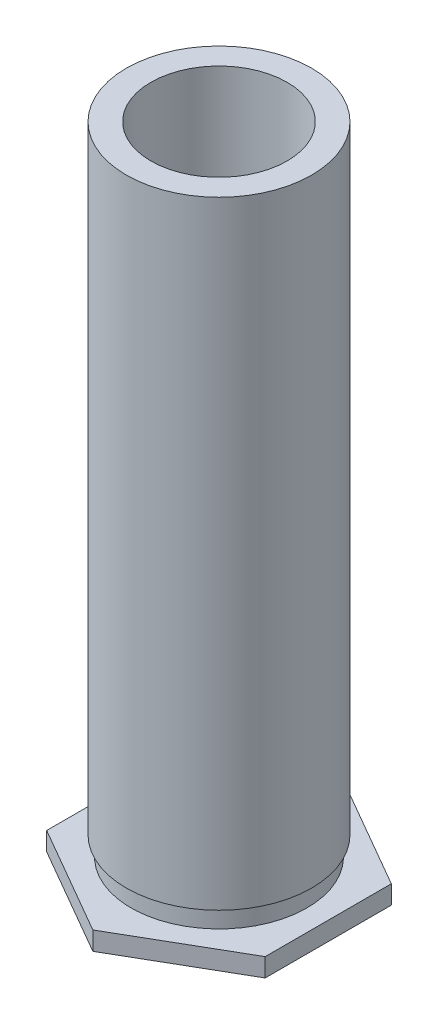
ISO-10303-21;
HEADER;
FILE_DESCRIPTION(('STEP AP214'),'2;1');
FILE_NAME('part.step','',(''),(''),'','','');
FILE_SCHEMA(('AUTOMOTIVE_DESIGN { 1 0 10303 214 1 1 1 1 }'));
ENDSEC;
DATA;
#1=APPLICATION_CONTEXT('core data for automotive mechanical design processes');
#2=APPLICATION_PROTOCOL_DEFINITION('international standard','automotive_design',2000,#1);
#3=PRODUCT_CONTEXT('',#1,'mechanical');
#4=PRODUCT('Part','Part','',(#3));
#5=PRODUCT_RELATED_PRODUCT_CATEGORY('part','',(#4));
#6=PRODUCT_DEFINITION_FORMATION('','',#4);
#7=PRODUCT_DEFINITION_CONTEXT('part definition',#1,'design');
#8=PRODUCT_DEFINITION('design','',#6,#7);
#9=PRODUCT_DEFINITION_SHAPE('','',#8);
#10=(LENGTH_UNIT() NAMED_UNIT(*) SI_UNIT(.MILLI.,.METRE.));
#11=(NAMED_UNIT(*) PLANE_ANGLE_UNIT() SI_UNIT($,.RADIAN.));
#12=(NAMED_UNIT(*) SI_UNIT($,.STERADIAN.) SOLID_ANGLE_UNIT());
#13=UNCERTAINTY_MEASURE_WITH_UNIT(LENGTH_MEASURE(1.E-05),#10,'distance_accuracy_value','');
#14=(GEOMETRIC_REPRESENTATION_CONTEXT(3) GLOBAL_UNCERTAINTY_ASSIGNED_CONTEXT((#13)) GLOBAL_UNIT_ASSIGNED_CONTEXT((#10,
#11,#12)) REPRESENTATION_CONTEXT('',''));
#15=CARTESIAN_POINT('',(0.,0.,0.));
#16=DIRECTION('',(0.,0.,1.));
#17=DIRECTION('',(1.,0.,0.));
#18=AXIS2_PLACEMENT_3D('',#15,#16,#17);
#19=CARTESIAN_POINT('',(3.683,0.53848,0.));
#20=DIRECTION('',(0.,1.,0.));
#21=DIRECTION('',(0.,0.,1.));
#22=AXIS2_PLACEMENT_3D('',#19,#20,#21);
#23=PLANE('',#22);
#24=CARTESIAN_POINT('',(0.,0.53848,0.));
#25=DIRECTION('',(0.,-1.,0.));
#26=DIRECTION('',(0.,0.,-1.));
#27=AXIS2_PLACEMENT_3D('',#24,#25,#26);
#28=CIRCLE('',#27,2.55778);
#29=CARTESIAN_POINT('',(0.,0.53848,-2.55778));
#30=VERTEX_POINT('',#29);
#31=EDGE_CURVE('E11',#30,#30,#28,.T.);
#32=ORIENTED_EDGE('',*,*,#31,.T.);
#33=EDGE_LOOP('',(#32));
#34=FACE_BOUND('',#33,.T.);
#35=DIRECTION('',(0.866025403784438,0.,0.5));
#36=VECTOR('',#35,1.);
#37=CARTESIAN_POINT('',(0.,0.53848,3.66617420935412));
#38=LINE('',#37,#36);
#39=CARTESIAN_POINT('',(-3.175,0.53848,1.83308710467706));
#40=VERTEX_POINT('',#39);
#41=CARTESIAN_POINT('',(0.,0.53848,3.66617420935412));
#42=VERTEX_POINT('',#41);
#43=EDGE_CURVE('E129',#40,#42,#38,.T.);
#44=ORIENTED_EDGE('',*,*,#43,.T.);
#45=DIRECTION('',(0.866025403784438,0.,-0.5));
#46=VECTOR('',#45,1.);
#47=CARTESIAN_POINT('',(3.175,0.53848,1.83308710467706));
#48=LINE('',#47,#46);
#49=CARTESIAN_POINT('',(3.175,0.53848,1.83308710467706));
#50=VERTEX_POINT('',#49);
#51=EDGE_CURVE('E118',#42,#50,#48,.T.);
#52=ORIENTED_EDGE('',*,*,#51,.T.);
#53=DIRECTION('',(0.,0.,-1.));
#54=VECTOR('',#53,1.);
#55=CARTESIAN_POINT('',(3.175,0.53848,-1.83308710467706));
#56=LINE('',#55,#54);
#57=CARTESIAN_POINT('',(3.175,0.53848,-1.83308710467706));
#58=VERTEX_POINT('',#57);
#59=EDGE_CURVE('E121',#50,#58,#56,.T.);
#60=ORIENTED_EDGE('',*,*,#59,.T.);
#61=DIRECTION('',(-0.866025403784438,0.,-0.5));
#62=VECTOR('',#61,1.);
#63=CARTESIAN_POINT('',(0.,0.53848,-3.66617420935412));
#64=LINE('',#63,#62);
#65=CARTESIAN_POINT('',(0.,0.53848,-3.66617420935412));
#66=VERTEX_POINT('',#65);
#67=EDGE_CURVE('E49',#58,#66,#64,.T.);
#68=ORIENTED_EDGE('',*,*,#67,.T.);
#69=DIRECTION('',(-0.866025403784438,0.,0.5));
#70=VECTOR('',#69,1.);
#71=CARTESIAN_POINT('',(-3.175,0.53848,-1.83308710467706));
#72=LINE('',#71,#70);
#73=CARTESIAN_POINT('',(-3.175,0.53848,-1.83308710467706));
#74=VERTEX_POINT('',#73);
#75=EDGE_CURVE('E94',#66,#74,#72,.T.);
#76=ORIENTED_EDGE('',*,*,#75,.T.);
#77=DIRECTION('',(0.,0.,1.));
#78=VECTOR('',#77,1.);
#79=CARTESIAN_POINT('',(-3.175,0.53848,1.83308710467706));
#80=LINE('',#79,#78);
#81=EDGE_CURVE('E126',#74,#40,#80,.T.);
#82=ORIENTED_EDGE('',*,*,#81,.T.);
#83=EDGE_LOOP('',(#44,#52,#60,#68,#76,#82));
#84=FACE_BOUND('',#83,.T.);
#85=ADVANCED_FACE('F33',(#34,#84),#23,.T.);
#86=CARTESIAN_POINT('',(2.6924,0.,0.));
#87=DIRECTION('',(0.,-1.,0.));
#88=DIRECTION('',(0.,0.,-1.));
#89=AXIS2_PLACEMENT_3D('',#86,#87,#88);
#90=PLANE('',#89);
#91=CARTESIAN_POINT('',(0.,0.,0.));
#92=DIRECTION('',(0.,-1.,0.));
#93=DIRECTION('',(0.,0.,-1.));
#94=AXIS2_PLACEMENT_3D('',#91,#92,#93);
#95=CIRCLE('',#94,2.6924);
#96=CARTESIAN_POINT('',(0.,0.,-2.6924));
#97=VERTEX_POINT('',#96);
#98=EDGE_CURVE('E148',#97,#97,#95,.T.);
#99=ORIENTED_EDGE('',*,*,#98,.F.);
#100=EDGE_LOOP('',(#99));
#101=FACE_BOUND('',#100,.T.);
#102=DIRECTION('',(0.,0.,-1.));
#103=VECTOR('',#102,1.);
#104=CARTESIAN_POINT('',(3.175,0.,-1.83308710467706));
#105=LINE('',#104,#103);
#106=CARTESIAN_POINT('',(3.175,0.,1.83308710467706));
#107=VERTEX_POINT('',#106);
#108=CARTESIAN_POINT('',(3.175,0.,-1.83308710467706));
#109=VERTEX_POINT('',#108);
#110=EDGE_CURVE('E104',#107,#109,#105,.T.);
#111=ORIENTED_EDGE('',*,*,#110,.F.);
#112=DIRECTION('',(0.866025403784438,0.,-0.5));
#113=VECTOR('',#112,1.);
#114=CARTESIAN_POINT('',(3.175,0.,1.83308710467706));
#115=LINE('',#114,#113);
#116=CARTESIAN_POINT('',(0.,0.,3.66617420935412));
#117=VERTEX_POINT('',#116);
#118=EDGE_CURVE('E57',#117,#107,#115,.T.);
#119=ORIENTED_EDGE('',*,*,#118,.F.);
#120=DIRECTION('',(0.866025403784438,0.,0.5));
#121=VECTOR('',#120,1.);
#122=CARTESIAN_POINT('',(0.,0.,3.66617420935412));
#123=LINE('',#122,#121);
#124=CARTESIAN_POINT('',(-3.175,0.,1.83308710467706));
#125=VERTEX_POINT('',#124);
#126=EDGE_CURVE('E111',#125,#117,#123,.T.);
#127=ORIENTED_EDGE('',*,*,#126,.F.);
#128=DIRECTION('',(0.,0.,1.));
#129=VECTOR('',#128,1.);
#130=CARTESIAN_POINT('',(-3.175,0.,1.83308710467706));
#131=LINE('',#130,#129);
#132=CARTESIAN_POINT('',(-3.175,0.,-1.83308710467706));
#133=VERTEX_POINT('',#132);
#134=EDGE_CURVE('E109',#133,#125,#131,.T.);
#135=ORIENTED_EDGE('',*,*,#134,.F.);
#136=DIRECTION('',(-0.866025403784438,0.,0.5));
#137=VECTOR('',#136,1.);
#138=CARTESIAN_POINT('',(-3.175,0.,-1.83308710467706));
#139=LINE('',#138,#137);
#140=CARTESIAN_POINT('',(0.,0.,-3.66617420935412));
#141=VERTEX_POINT('',#140);
#142=EDGE_CURVE('E91',#141,#133,#139,.T.);
#143=ORIENTED_EDGE('',*,*,#142,.F.);
#144=DIRECTION('',(-0.866025403784438,0.,-0.5));
#145=VECTOR('',#144,1.);
#146=CARTESIAN_POINT('',(0.,0.,-3.66617420935412));
#147=LINE('',#146,#145);
#148=EDGE_CURVE('E99',#109,#141,#147,.T.);
#149=ORIENTED_EDGE('',*,*,#148,.F.);
#150=EDGE_LOOP('',(#111,#119,#127,#135,#143,#149));
#151=FACE_BOUND('',#150,.T.);
#152=ADVANCED_FACE('F106',(#101,#151),#90,.T.);
#153=CARTESIAN_POINT('',(0.,0.,0.));
#154=DIRECTION('',(0.,-1.,0.));
#155=DIRECTION('',(0.,0.,-1.));
#156=AXIS2_PLACEMENT_3D('',#153,#154,#155);
#157=CYLINDRICAL_SURFACE('',#156,2.55778);
#158=CARTESIAN_POINT('',(0.,1.103884,0.));
#159=DIRECTION('',(0.,-1.,0.));
#160=DIRECTION('',(0.,0.,-1.));
#161=AXIS2_PLACEMENT_3D('',#158,#159,#160);
#162=CIRCLE('',#161,2.55778);
#163=CARTESIAN_POINT('',(0.,1.103884,-2.55778));
#164=VERTEX_POINT('',#163);
#165=EDGE_CURVE('E41',#164,#164,#162,.T.);
#166=ORIENTED_EDGE('',*,*,#165,.T.);
#167=EDGE_LOOP('',(#166));
#168=FACE_BOUND('',#167,.T.);
#169=ORIENTED_EDGE('',*,*,#31,.F.);
#170=EDGE_LOOP('',(#169));
#171=FACE_BOUND('',#170,.T.);
#172=ADVANCED_FACE('F187',(#168,#171),#157,.T.);
#173=CARTESIAN_POINT('',(2.6924,1.103884,0.));
#174=DIRECTION('',(0.,-1.,0.));
#175=DIRECTION('',(0.,0.,-1.));
#176=AXIS2_PLACEMENT_3D('',#173,#174,#175);
#177=PLANE('',#176);
#178=CARTESIAN_POINT('',(0.,1.103884,0.));
#179=DIRECTION('',(0.,-1.,0.));
#180=DIRECTION('',(0.,0.,-1.));
#181=AXIS2_PLACEMENT_3D('',#178,#179,#180);
#182=CIRCLE('',#181,2.6924);
#183=CARTESIAN_POINT('',(0.,1.103884,-2.6924));
#184=VERTEX_POINT('',#183);
#185=EDGE_CURVE('E158',#184,#184,#182,.T.);
#186=ORIENTED_EDGE('',*,*,#185,.T.);
#187=EDGE_LOOP('',(#186));
#188=FACE_BOUND('',#187,.T.);
#189=ORIENTED_EDGE('',*,*,#165,.F.);
#190=EDGE_LOOP('',(#189));
#191=FACE_BOUND('',#190,.T.);
#192=ADVANCED_FACE('F181',(#188,#191),#177,.T.);
#193=CARTESIAN_POINT('',(0.,0.,0.));
#194=DIRECTION('',(0.,-1.,0.));
#195=DIRECTION('',(0.,0.,-1.));
#196=AXIS2_PLACEMENT_3D('',#193,#194,#195);
#197=CYLINDRICAL_SURFACE('',#196,2.6924);
#198=CARTESIAN_POINT('',(0.,19.05,0.));
#199=DIRECTION('',(0.,-1.,0.));
#200=DIRECTION('',(0.,0.,-1.));
#201=AXIS2_PLACEMENT_3D('',#198,#199,#200);
#202=CIRCLE('',#201,2.6924);
#203=CARTESIAN_POINT('',(0.,19.05,-2.6924));
#204=VERTEX_POINT('',#203);
#205=EDGE_CURVE('E155',#204,#204,#202,.T.);
#206=ORIENTED_EDGE('',*,*,#205,.T.);
#207=EDGE_LOOP('',(#206));
#208=FACE_BOUND('',#207,.T.);
#209=ORIENTED_EDGE('',*,*,#185,.F.);
#210=EDGE_LOOP('',(#209));
#211=FACE_BOUND('',#210,.T.);
#212=ADVANCED_FACE('F175',(#208,#211),#197,.T.);
#213=CARTESIAN_POINT('',(2.6924,19.05,0.));
#214=DIRECTION('',(0.,1.,0.));
#215=DIRECTION('',(0.,0.,1.));
#216=AXIS2_PLACEMENT_3D('',#213,#214,#215);
#217=PLANE('',#216);
#218=CARTESIAN_POINT('',(0.,19.05,0.));
#219=DIRECTION('',(0.,1.,0.));
#220=DIRECTION('',(0.,0.,1.));
#221=AXIS2_PLACEMENT_3D('',#218,#219,#220);
#222=CIRCLE('',#221,1.9812);
#223=CARTESIAN_POINT('',(0.,19.05,1.9812));
#224=VERTEX_POINT('',#223);
#225=EDGE_CURVE('E36',#224,#224,#222,.T.);
#226=ORIENTED_EDGE('',*,*,#225,.F.);
#227=EDGE_LOOP('',(#226));
#228=FACE_BOUND('',#227,.T.);
#229=ORIENTED_EDGE('',*,*,#205,.F.);
#230=EDGE_LOOP('',(#229));
#231=FACE_BOUND('',#230,.T.);
#232=ADVANCED_FACE('F171',(#228,#231),#217,.T.);
#233=CARTESIAN_POINT('',(0.,0.,0.));
#234=DIRECTION('',(0.,-1.,0.));
#235=DIRECTION('',(0.,0.,-1.));
#236=AXIS2_PLACEMENT_3D('',#233,#234,#235);
#237=CYLINDRICAL_SURFACE('',#236,1.35255);
#238=CARTESIAN_POINT('',(0.,10.8451860165415,0.));
#239=DIRECTION('',(0.,-1.,0.));
#240=DIRECTION('',(0.,0.,-1.));
#241=AXIS2_PLACEMENT_3D('',#238,#239,#240);
#242=CIRCLE('',#241,1.35255);
#243=CARTESIAN_POINT('',(0.,10.8451860165415,-1.35255));
#244=VERTEX_POINT('',#243);
#245=EDGE_CURVE('E142',#244,#244,#242,.T.);
#246=ORIENTED_EDGE('',*,*,#245,.F.);
#247=EDGE_LOOP('',(#246));
#248=FACE_BOUND('',#247,.T.);
#249=CARTESIAN_POINT('',(0.,0.00253999999999972,0.));
#250=DIRECTION('',(0.,-1.,0.));
#251=DIRECTION('',(0.,0.,-1.));
#252=AXIS2_PLACEMENT_3D('',#249,#250,#251);
#253=CIRCLE('',#252,1.35255);
#254=CARTESIAN_POINT('',(0.,0.00253999999999972,-1.35255));
#255=VERTEX_POINT('',#254);
#256=EDGE_CURVE('E152',#255,#255,#253,.T.);
#257=ORIENTED_EDGE('',*,*,#256,.T.);
#258=EDGE_LOOP('',(#257));
#259=FACE_BOUND('',#258,.T.);
#260=ADVANCED_FACE('F174',(#248,#259),#237,.F.);
#261=CARTESIAN_POINT('',(2.6924,0.00253999999999972,0.));
#262=DIRECTION('',(0.,-1.,0.));
#263=DIRECTION('',(0.,0.,-1.));
#264=AXIS2_PLACEMENT_3D('',#261,#262,#263);
#265=PLANE('',#264);
#266=ORIENTED_EDGE('',*,*,#256,.F.);
#267=EDGE_LOOP('',(#266));
#268=FACE_BOUND('',#267,.T.);
#269=CARTESIAN_POINT('',(0.,0.00253999999999989,0.));
#270=DIRECTION('',(0.,-1.,0.));
#271=DIRECTION('',(0.,0.,-1.));
#272=AXIS2_PLACEMENT_3D('',#269,#270,#271);
#273=CIRCLE('',#272,2.6924);
#274=CARTESIAN_POINT('',(0.,0.00253999999999989,-2.6924));
#275=VERTEX_POINT('',#274);
#276=EDGE_CURVE('E151',#275,#275,#273,.T.);
#277=ORIENTED_EDGE('',*,*,#276,.T.);
#278=EDGE_LOOP('',(#277));
#279=FACE_BOUND('',#278,.T.);
#280=ADVANCED_FACE('F233',(#268,#279),#265,.T.);
#281=CARTESIAN_POINT('',(0.,0.,0.));
#282=DIRECTION('',(0.,-1.,0.));
#283=DIRECTION('',(0.,0.,-1.));
#284=AXIS2_PLACEMENT_3D('',#281,#282,#283);
#285=CYLINDRICAL_SURFACE('',#284,2.6924);
#286=ORIENTED_EDGE('',*,*,#98,.T.);
#287=EDGE_LOOP('',(#286));
#288=FACE_BOUND('',#287,.T.);
#289=ORIENTED_EDGE('',*,*,#276,.F.);
#290=EDGE_LOOP('',(#289));
#291=FACE_BOUND('',#290,.T.);
#292=ADVANCED_FACE('F226',(#288,#291),#285,.F.);
#293=CARTESIAN_POINT('',(1.9812,11.1252,0.));
#294=DIRECTION('',(0.,-1.,0.));
#295=DIRECTION('',(0.,0.,-1.));
#296=AXIS2_PLACEMENT_3D('',#293,#294,#295);
#297=PLANE('',#296);
#298=CARTESIAN_POINT('',(0.,11.1252,0.));
#299=DIRECTION('',(0.,-1.,0.));
#300=DIRECTION('',(0.,0.,-1.));
#301=AXIS2_PLACEMENT_3D('',#298,#299,#300);
#302=CIRCLE('',#301,1.9812);
#303=CARTESIAN_POINT('',(0.,11.1252,-1.9812));
#304=VERTEX_POINT('',#303);
#305=EDGE_CURVE('E134',#304,#304,#302,.T.);
#306=ORIENTED_EDGE('',*,*,#305,.F.);
#307=EDGE_LOOP('',(#306));
#308=FACE_BOUND('',#307,.T.);
#309=CARTESIAN_POINT('',(0.,11.1252,0.));
#310=DIRECTION('',(0.,-1.,0.));
#311=DIRECTION('',(0.,0.,-1.));
#312=AXIS2_PLACEMENT_3D('',#309,#310,#311);
#313=CIRCLE('',#312,1.7526);
#314=CARTESIAN_POINT('',(0.,11.1252,-1.7526));
#315=VERTEX_POINT('',#314);
#316=EDGE_CURVE('E145',#315,#315,#313,.T.);
#317=ORIENTED_EDGE('',*,*,#316,.T.);
#318=EDGE_LOOP('',(#317));
#319=FACE_BOUND('',#318,.T.);
#320=ADVANCED_FACE('F222',(#308,#319),#297,.F.);
#321=CARTESIAN_POINT('',(0.,10.8451860165415,0.));
#322=DIRECTION('',(0.,1.,0.));
#323=DIRECTION('',(0.,0.,1.));
#324=AXIS2_PLACEMENT_3D('',#321,#322,#323);
#325=CONICAL_SURFACE('',#324,1.35255,0.960105621522078);
#326=ORIENTED_EDGE('',*,*,#316,.F.);
#327=EDGE_LOOP('',(#326));
#328=FACE_BOUND('',#327,.T.);
#329=ORIENTED_EDGE('',*,*,#245,.T.);
#330=EDGE_LOOP('',(#329));
#331=FACE_BOUND('',#330,.T.);
#332=ADVANCED_FACE('F219',(#328,#331),#325,.F.);
#333=CARTESIAN_POINT('',(0.,-2.54,0.));
#334=DIRECTION('',(0.,-1.,0.));
#335=DIRECTION('',(0.,0.,-1.));
#336=AXIS2_PLACEMENT_3D('',#333,#334,#335);
#337=CYLINDRICAL_SURFACE('',#336,1.9812);
#338=ORIENTED_EDGE('',*,*,#225,.T.);
#339=EDGE_LOOP('',(#338));
#340=FACE_BOUND('',#339,.T.);
#341=ORIENTED_EDGE('',*,*,#305,.T.);
#342=EDGE_LOOP('',(#341));
#343=FACE_BOUND('',#342,.T.);
#344=ADVANCED_FACE('F168',(#340,#343),#337,.F.);
#345=CARTESIAN_POINT('',(3.175,0.,1.83308710467706));
#346=DIRECTION('',(0.5,0.,0.866025403784438));
#347=DIRECTION('',(0.866025403784439,0.,-0.5));
#348=AXIS2_PLACEMENT_3D('',#345,#346,#347);
#349=PLANE('',#348);
#350=ORIENTED_EDGE('',*,*,#51,.F.);
#351=DIRECTION('',(0.,1.,0.));
#352=VECTOR('',#351,1.);
#353=CARTESIAN_POINT('',(0.,0.,3.66617420935412));
#354=LINE('',#353,#352);
#355=EDGE_CURVE('E132',#117,#42,#354,.T.);
#356=ORIENTED_EDGE('',*,*,#355,.F.);
#357=ORIENTED_EDGE('',*,*,#118,.T.);
#358=DIRECTION('',(0.,1.,0.));
#359=VECTOR('',#358,1.);
#360=CARTESIAN_POINT('',(3.175,0.,1.83308710467706));
#361=LINE('',#360,#359);
#362=EDGE_CURVE('E117',#107,#50,#361,.T.);
#363=ORIENTED_EDGE('',*,*,#362,.T.);
#364=EDGE_LOOP('',(#350,#356,#357,#363));
#365=FACE_BOUND('',#364,.T.);
#366=ADVANCED_FACE('F202',(#365),#349,.T.);
#367=CARTESIAN_POINT('',(0.,0.,3.66617420935412));
#368=DIRECTION('',(-0.5,0.,0.866025403784438));
#369=DIRECTION('',(0.866025403784439,0.,0.5));
#370=AXIS2_PLACEMENT_3D('',#367,#368,#369);
#371=PLANE('',#370);
#372=ORIENTED_EDGE('',*,*,#43,.F.);
#373=DIRECTION('',(0.,1.,0.));
#374=VECTOR('',#373,1.);
#375=CARTESIAN_POINT('',(-3.175,0.,1.83308710467706));
#376=LINE('',#375,#374);
#377=EDGE_CURVE('E135',#125,#40,#376,.T.);
#378=ORIENTED_EDGE('',*,*,#377,.F.);
#379=ORIENTED_EDGE('',*,*,#126,.T.);
#380=ORIENTED_EDGE('',*,*,#355,.T.);
#381=EDGE_LOOP('',(#372,#378,#379,#380));
#382=FACE_BOUND('',#381,.T.);
#383=ADVANCED_FACE('F201',(#382),#371,.T.);
#384=CARTESIAN_POINT('',(-3.175,0.,1.83308710467706));
#385=DIRECTION('',(-1.,0.,0.));
#386=DIRECTION('',(0.,0.,1.));
#387=AXIS2_PLACEMENT_3D('',#384,#385,#386);
#388=PLANE('',#387);
#389=ORIENTED_EDGE('',*,*,#81,.F.);
#390=DIRECTION('',(0.,1.,0.));
#391=VECTOR('',#390,1.);
#392=CARTESIAN_POINT('',(-3.175,0.,-1.83308710467706));
#393=LINE('',#392,#391);
#394=EDGE_CURVE('E95',#133,#74,#393,.T.);
#395=ORIENTED_EDGE('',*,*,#394,.F.);
#396=ORIENTED_EDGE('',*,*,#134,.T.);
#397=ORIENTED_EDGE('',*,*,#377,.T.);
#398=EDGE_LOOP('',(#389,#395,#396,#397));
#399=FACE_BOUND('',#398,.T.);
#400=ADVANCED_FACE('F279',(#399),#388,.T.);
#401=CARTESIAN_POINT('',(-3.175,0.,-1.83308710467706));
#402=DIRECTION('',(-0.5,0.,-0.866025403784438));
#403=DIRECTION('',(-0.866025403784439,0.,0.5));
#404=AXIS2_PLACEMENT_3D('',#401,#402,#403);
#405=PLANE('',#404);
#406=ORIENTED_EDGE('',*,*,#75,.F.);
#407=DIRECTION('',(0.,1.,0.));
#408=VECTOR('',#407,1.);
#409=CARTESIAN_POINT('',(0.,0.,-3.66617420935412));
#410=LINE('',#409,#408);
#411=EDGE_CURVE('E87',#141,#66,#410,.T.);
#412=ORIENTED_EDGE('',*,*,#411,.F.);
#413=ORIENTED_EDGE('',*,*,#142,.T.);
#414=ORIENTED_EDGE('',*,*,#394,.T.);
#415=EDGE_LOOP('',(#406,#412,#413,#414));
#416=FACE_BOUND('',#415,.T.);
#417=ADVANCED_FACE('F89',(#416),#405,.T.);
#418=CARTESIAN_POINT('',(0.,0.,-3.66617420935412));
#419=DIRECTION('',(0.5,0.,-0.866025403784438));
#420=DIRECTION('',(-0.866025403784439,0.,-0.5));
#421=AXIS2_PLACEMENT_3D('',#418,#419,#420);
#422=PLANE('',#421);
#423=ORIENTED_EDGE('',*,*,#67,.F.);
#424=DIRECTION('',(0.,1.,0.));
#425=VECTOR('',#424,1.);
#426=CARTESIAN_POINT('',(3.175,0.,-1.83308710467706));
#427=LINE('',#426,#425);
#428=EDGE_CURVE('E96',#109,#58,#427,.T.);
#429=ORIENTED_EDGE('',*,*,#428,.F.);
#430=ORIENTED_EDGE('',*,*,#148,.T.);
#431=ORIENTED_EDGE('',*,*,#411,.T.);
#432=EDGE_LOOP('',(#423,#429,#430,#431));
#433=FACE_BOUND('',#432,.T.);
#434=ADVANCED_FACE('F100',(#433),#422,.T.);
#435=CARTESIAN_POINT('',(3.175,0.,-1.83308710467706));
#436=DIRECTION('',(1.,0.,0.));
#437=DIRECTION('',(0.,0.,-1.));
#438=AXIS2_PLACEMENT_3D('',#435,#436,#437);
#439=PLANE('',#438);
#440=ORIENTED_EDGE('',*,*,#59,.F.);
#441=ORIENTED_EDGE('',*,*,#362,.F.);
#442=ORIENTED_EDGE('',*,*,#110,.T.);
#443=ORIENTED_EDGE('',*,*,#428,.T.);
#444=EDGE_LOOP('',(#440,#441,#442,#443));
#445=FACE_BOUND('',#444,.T.);
#446=ADVANCED_FACE('F205',(#445),#439,.T.);
#447=CLOSED_SHELL('',(#85,#152,#172,#192,#212,#232,#260,#280,#292,#320,#332,#344,#366,#383,#400,
#417,#434,#446));
#448=MANIFOLD_SOLID_BREP('B2',#447);
#449=ADVANCED_BREP_SHAPE_REPRESENTATION('',(#18,#448),#14);
#450=SHAPE_DEFINITION_REPRESENTATION(#9,#449);
ENDSEC;
END-ISO-10303-21;
